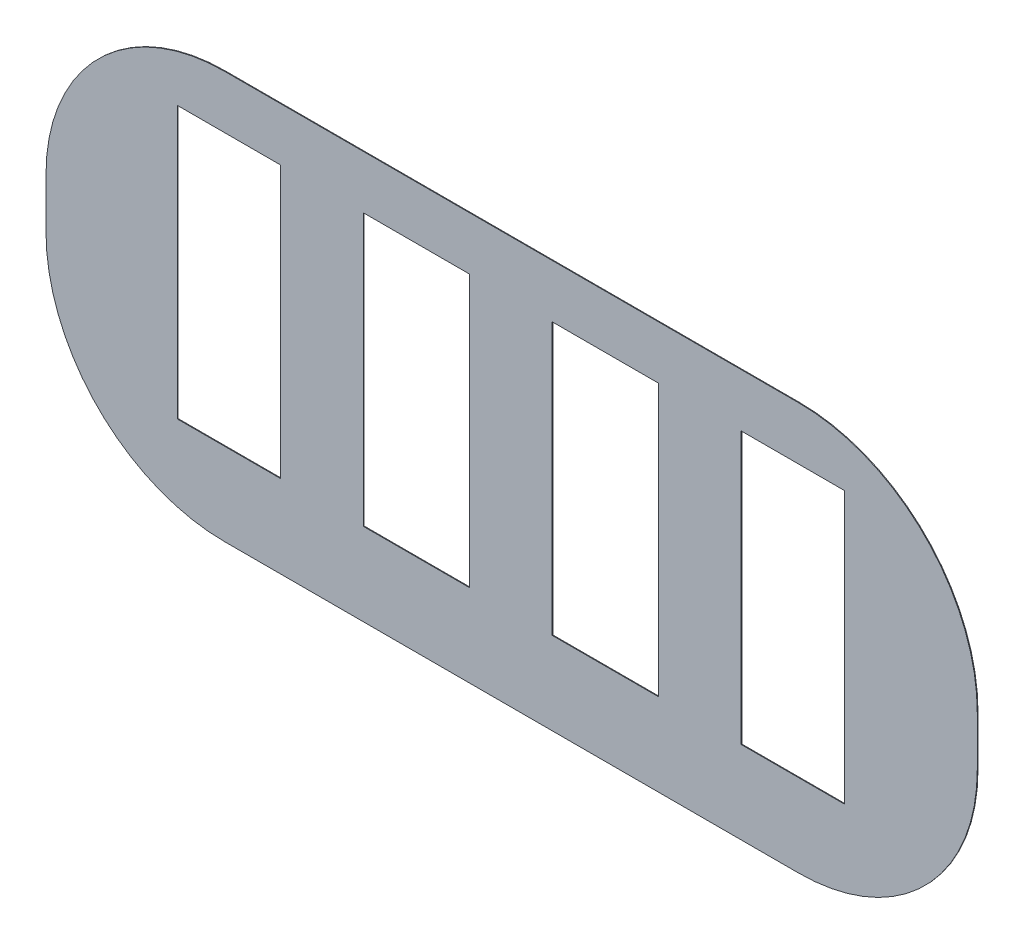
ISO-10303-21;
HEADER;
FILE_DESCRIPTION(('STEP AP214'),'2;1');
FILE_NAME('part.step','',(''),(''),'','','');
FILE_SCHEMA(('AUTOMOTIVE_DESIGN { 1 0 10303 214 1 1 1 1 }'));
ENDSEC;
DATA;
#1=APPLICATION_CONTEXT('core data for automotive mechanical design processes');
#2=APPLICATION_PROTOCOL_DEFINITION('international standard','automotive_design',2000,#1);
#3=PRODUCT_CONTEXT('',#1,'mechanical');
#4=PRODUCT('Part','Part','',(#3));
#5=PRODUCT_RELATED_PRODUCT_CATEGORY('part','',(#4));
#6=PRODUCT_DEFINITION_FORMATION('','',#4);
#7=PRODUCT_DEFINITION_CONTEXT('part definition',#1,'design');
#8=PRODUCT_DEFINITION('design','',#6,#7);
#9=PRODUCT_DEFINITION_SHAPE('','',#8);
#10=(LENGTH_UNIT() NAMED_UNIT(*) SI_UNIT(.MILLI.,.METRE.));
#11=(NAMED_UNIT(*) PLANE_ANGLE_UNIT() SI_UNIT($,.RADIAN.));
#12=(NAMED_UNIT(*) SI_UNIT($,.STERADIAN.) SOLID_ANGLE_UNIT());
#13=UNCERTAINTY_MEASURE_WITH_UNIT(LENGTH_MEASURE(1.E-05),#10,'distance_accuracy_value','');
#14=(GEOMETRIC_REPRESENTATION_CONTEXT(3) GLOBAL_UNCERTAINTY_ASSIGNED_CONTEXT((#13)) GLOBAL_UNIT_ASSIGNED_CONTEXT((#10,
#11,#12)) REPRESENTATION_CONTEXT('',''));
#15=CARTESIAN_POINT('',(0.,0.,0.));
#16=DIRECTION('',(0.,0.,1.));
#17=DIRECTION('',(1.,0.,0.));
#18=AXIS2_PLACEMENT_3D('',#15,#16,#17);
#19=CARTESIAN_POINT('',(12.954,3.0734,0.0127));
#20=DIRECTION('',(0.,0.,-1.));
#21=DIRECTION('',(-1.,0.,0.));
#22=AXIS2_PLACEMENT_3D('',#19,#20,#21);
#23=CYLINDRICAL_SURFACE('',#22,3.0734);
#24=CARTESIAN_POINT('',(12.954,3.0734,0.));
#25=DIRECTION('',(0.,0.,1.));
#26=DIRECTION('',(1.,0.,0.));
#27=AXIS2_PLACEMENT_3D('',#24,#25,#26);
#28=CIRCLE('',#27,3.0734);
#29=CARTESIAN_POINT('',(12.954,0.,0.));
#30=VERTEX_POINT('',#29);
#31=CARTESIAN_POINT('',(16.0274,3.0734,0.));
#32=VERTEX_POINT('',#31);
#33=EDGE_CURVE('E383',#30,#32,#28,.T.);
#34=ORIENTED_EDGE('',*,*,#33,.T.);
#35=DIRECTION('',(0.,0.,-1.));
#36=VECTOR('',#35,1.);
#37=CARTESIAN_POINT('',(16.0274,3.0734,0.0127));
#38=LINE('',#37,#36);
#39=CARTESIAN_POINT('',(16.0274,3.0734,0.0127));
#40=VERTEX_POINT('',#39);
#41=EDGE_CURVE('E11',#40,#32,#38,.T.);
#42=ORIENTED_EDGE('',*,*,#41,.F.);
#43=CARTESIAN_POINT('',(12.954,3.0734,0.0127));
#44=DIRECTION('',(0.,0.,1.));
#45=DIRECTION('',(1.,0.,0.));
#46=AXIS2_PLACEMENT_3D('',#43,#44,#45);
#47=CIRCLE('',#46,3.0734);
#48=CARTESIAN_POINT('',(12.954,0.,0.0127));
#49=VERTEX_POINT('',#48);
#50=EDGE_CURVE('E393',#49,#40,#47,.T.);
#51=ORIENTED_EDGE('',*,*,#50,.F.);
#52=DIRECTION('',(0.,0.,-1.));
#53=VECTOR('',#52,1.);
#54=CARTESIAN_POINT('',(12.954,0.,0.0127));
#55=LINE('',#54,#53);
#56=EDGE_CURVE('E419',#49,#30,#55,.T.);
#57=ORIENTED_EDGE('',*,*,#56,.T.);
#58=EDGE_LOOP('',(#34,#42,#51,#57));
#59=FACE_BOUND('',#58,.T.);
#60=ADVANCED_FACE('F48',(#59),#23,.T.);
#61=CARTESIAN_POINT('',(16.0274,3.0734,0.0127));
#62=DIRECTION('',(-1.,0.,0.));
#63=DIRECTION('',(0.,0.,1.));
#64=AXIS2_PLACEMENT_3D('',#61,#62,#63);
#65=PLANE('',#64);
#66=DIRECTION('',(0.,1.,0.));
#67=VECTOR('',#66,1.);
#68=CARTESIAN_POINT('',(16.0274,3.0734,0.));
#69=LINE('',#68,#67);
#70=CARTESIAN_POINT('',(16.0274,3.937,0.));
#71=VERTEX_POINT('',#70);
#72=EDGE_CURVE('E423',#32,#71,#69,.T.);
#73=ORIENTED_EDGE('',*,*,#72,.T.);
#74=DIRECTION('',(0.,0.,-1.));
#75=VECTOR('',#74,1.);
#76=CARTESIAN_POINT('',(16.0274,3.937,0.0127));
#77=LINE('',#76,#75);
#78=CARTESIAN_POINT('',(16.0274,3.937,0.0127));
#79=VERTEX_POINT('',#78);
#80=EDGE_CURVE('E56',#79,#71,#77,.T.);
#81=ORIENTED_EDGE('',*,*,#80,.F.);
#82=DIRECTION('',(0.,1.,0.));
#83=VECTOR('',#82,1.);
#84=CARTESIAN_POINT('',(16.0274,3.0734,0.0127));
#85=LINE('',#84,#83);
#86=EDGE_CURVE('E397',#40,#79,#85,.T.);
#87=ORIENTED_EDGE('',*,*,#86,.F.);
#88=ORIENTED_EDGE('',*,*,#41,.T.);
#89=EDGE_LOOP('',(#73,#81,#87,#88));
#90=FACE_BOUND('',#89,.T.);
#91=ADVANCED_FACE('F494',(#90),#65,.F.);
#92=CARTESIAN_POINT('',(12.954,3.937,0.0127));
#93=DIRECTION('',(0.,0.,-1.));
#94=DIRECTION('',(-1.,0.,0.));
#95=AXIS2_PLACEMENT_3D('',#92,#93,#94);
#96=CYLINDRICAL_SURFACE('',#95,3.0734);
#97=CARTESIAN_POINT('',(12.954,3.937,0.));
#98=DIRECTION('',(0.,0.,1.));
#99=DIRECTION('',(-1.,0.,0.));
#100=AXIS2_PLACEMENT_3D('',#97,#98,#99);
#101=CIRCLE('',#100,3.0734);
#102=CARTESIAN_POINT('',(12.954,7.0104,0.));
#103=VERTEX_POINT('',#102);
#104=EDGE_CURVE('E426',#71,#103,#101,.T.);
#105=ORIENTED_EDGE('',*,*,#104,.T.);
#106=DIRECTION('',(0.,0.,-1.));
#107=VECTOR('',#106,1.);
#108=CARTESIAN_POINT('',(12.954,7.0104,0.0127));
#109=LINE('',#108,#107);
#110=CARTESIAN_POINT('',(12.954,7.0104,0.0127));
#111=VERTEX_POINT('',#110);
#112=EDGE_CURVE('E462',#111,#103,#109,.T.);
#113=ORIENTED_EDGE('',*,*,#112,.F.);
#114=CARTESIAN_POINT('',(12.954,3.937,0.0127));
#115=DIRECTION('',(0.,0.,1.));
#116=DIRECTION('',(-1.,0.,0.));
#117=AXIS2_PLACEMENT_3D('',#114,#115,#116);
#118=CIRCLE('',#117,3.0734);
#119=EDGE_CURVE('E401',#79,#111,#118,.T.);
#120=ORIENTED_EDGE('',*,*,#119,.F.);
#121=ORIENTED_EDGE('',*,*,#80,.T.);
#122=EDGE_LOOP('',(#105,#113,#120,#121));
#123=FACE_BOUND('',#122,.T.);
#124=ADVANCED_FACE('F472',(#123),#96,.T.);
#125=CARTESIAN_POINT('',(3.07340000000002,7.0104,0.0127));
#126=DIRECTION('',(0.,-1.,0.));
#127=DIRECTION('',(1.,0.,0.));
#128=AXIS2_PLACEMENT_3D('',#125,#126,#127);
#129=PLANE('',#128);
#130=DIRECTION('',(-1.,0.,0.));
#131=VECTOR('',#130,1.);
#132=CARTESIAN_POINT('',(3.07340000000002,7.0104,0.));
#133=LINE('',#132,#131);
#134=CARTESIAN_POINT('',(3.07340000000002,7.0104,0.));
#135=VERTEX_POINT('',#134);
#136=EDGE_CURVE('E429',#103,#135,#133,.T.);
#137=ORIENTED_EDGE('',*,*,#136,.T.);
#138=DIRECTION('',(0.,0.,-1.));
#139=VECTOR('',#138,1.);
#140=CARTESIAN_POINT('',(3.07340000000002,7.0104,0.0127));
#141=LINE('',#140,#139);
#142=CARTESIAN_POINT('',(3.07340000000002,7.0104,0.0127));
#143=VERTEX_POINT('',#142);
#144=EDGE_CURVE('E458',#143,#135,#141,.T.);
#145=ORIENTED_EDGE('',*,*,#144,.F.);
#146=DIRECTION('',(-1.,0.,0.));
#147=VECTOR('',#146,1.);
#148=CARTESIAN_POINT('',(3.07340000000002,7.0104,0.0127));
#149=LINE('',#148,#147);
#150=EDGE_CURVE('E404',#111,#143,#149,.T.);
#151=ORIENTED_EDGE('',*,*,#150,.F.);
#152=ORIENTED_EDGE('',*,*,#112,.T.);
#153=EDGE_LOOP('',(#137,#145,#151,#152));
#154=FACE_BOUND('',#153,.T.);
#155=ADVANCED_FACE('F482',(#154),#129,.F.);
#156=CARTESIAN_POINT('',(3.0734,3.937,0.0127));
#157=DIRECTION('',(0.,0.,-1.));
#158=DIRECTION('',(-1.,0.,0.));
#159=AXIS2_PLACEMENT_3D('',#156,#157,#158);
#160=CYLINDRICAL_SURFACE('',#159,3.0734);
#161=CARTESIAN_POINT('',(3.0734,3.937,0.));
#162=DIRECTION('',(0.,0.,1.));
#163=DIRECTION('',(-1.,0.,0.));
#164=AXIS2_PLACEMENT_3D('',#161,#162,#163);
#165=CIRCLE('',#164,3.0734);
#166=CARTESIAN_POINT('',(0.,3.93699999999998,0.));
#167=VERTEX_POINT('',#166);
#168=EDGE_CURVE('E432',#135,#167,#165,.T.);
#169=ORIENTED_EDGE('',*,*,#168,.T.);
#170=DIRECTION('',(0.,0.,-1.));
#171=VECTOR('',#170,1.);
#172=CARTESIAN_POINT('',(0.,3.93699999999998,0.0127));
#173=LINE('',#172,#171);
#174=CARTESIAN_POINT('',(0.,3.93699999999998,0.0127));
#175=VERTEX_POINT('',#174);
#176=EDGE_CURVE('E454',#175,#167,#173,.T.);
#177=ORIENTED_EDGE('',*,*,#176,.F.);
#178=CARTESIAN_POINT('',(3.0734,3.937,0.0127));
#179=DIRECTION('',(0.,0.,1.));
#180=DIRECTION('',(-1.,0.,0.));
#181=AXIS2_PLACEMENT_3D('',#178,#179,#180);
#182=CIRCLE('',#181,3.0734);
#183=EDGE_CURVE('E407',#143,#175,#182,.T.);
#184=ORIENTED_EDGE('',*,*,#183,.F.);
#185=ORIENTED_EDGE('',*,*,#144,.T.);
#186=EDGE_LOOP('',(#169,#177,#184,#185));
#187=FACE_BOUND('',#186,.T.);
#188=ADVANCED_FACE('F486',(#187),#160,.T.);
#189=CARTESIAN_POINT('',(0.,3.07340000000002,0.0127));
#190=DIRECTION('',(1.,0.,0.));
#191=DIRECTION('',(0.,0.,-1.));
#192=AXIS2_PLACEMENT_3D('',#189,#190,#191);
#193=PLANE('',#192);
#194=DIRECTION('',(0.,-1.,0.));
#195=VECTOR('',#194,1.);
#196=CARTESIAN_POINT('',(0.,3.07340000000002,0.));
#197=LINE('',#196,#195);
#198=CARTESIAN_POINT('',(0.,3.0734,0.));
#199=VERTEX_POINT('',#198);
#200=EDGE_CURVE('E435',#167,#199,#197,.T.);
#201=ORIENTED_EDGE('',*,*,#200,.T.);
#202=DIRECTION('',(0.,0.,-1.));
#203=VECTOR('',#202,1.);
#204=CARTESIAN_POINT('',(0.,3.0734,0.0127));
#205=LINE('',#204,#203);
#206=CARTESIAN_POINT('',(0.,3.0734,0.0127));
#207=VERTEX_POINT('',#206);
#208=EDGE_CURVE('E450',#207,#199,#205,.T.);
#209=ORIENTED_EDGE('',*,*,#208,.F.);
#210=DIRECTION('',(0.,-1.,0.));
#211=VECTOR('',#210,1.);
#212=CARTESIAN_POINT('',(0.,3.07340000000002,0.0127));
#213=LINE('',#212,#211);
#214=EDGE_CURVE('E410',#175,#207,#213,.T.);
#215=ORIENTED_EDGE('',*,*,#214,.F.);
#216=ORIENTED_EDGE('',*,*,#176,.T.);
#217=EDGE_LOOP('',(#201,#209,#215,#216));
#218=FACE_BOUND('',#217,.T.);
#219=ADVANCED_FACE('F507',(#218),#193,.F.);
#220=CARTESIAN_POINT('',(3.0734,3.0734,0.0127));
#221=DIRECTION('',(0.,0.,-1.));
#222=DIRECTION('',(-1.,0.,0.));
#223=AXIS2_PLACEMENT_3D('',#220,#221,#222);
#224=CYLINDRICAL_SURFACE('',#223,3.0734);
#225=CARTESIAN_POINT('',(3.0734,3.0734,0.));
#226=DIRECTION('',(0.,0.,1.));
#227=DIRECTION('',(-1.,0.,0.));
#228=AXIS2_PLACEMENT_3D('',#225,#226,#227);
#229=CIRCLE('',#228,3.0734);
#230=CARTESIAN_POINT('',(3.07340000000002,0.,0.));
#231=VERTEX_POINT('',#230);
#232=EDGE_CURVE('E438',#199,#231,#229,.T.);
#233=ORIENTED_EDGE('',*,*,#232,.T.);
#234=DIRECTION('',(0.,0.,-1.));
#235=VECTOR('',#234,1.);
#236=CARTESIAN_POINT('',(3.07340000000002,0.,0.0127));
#237=LINE('',#236,#235);
#238=CARTESIAN_POINT('',(3.07340000000002,0.,0.0127));
#239=VERTEX_POINT('',#238);
#240=EDGE_CURVE('E446',#239,#231,#237,.T.);
#241=ORIENTED_EDGE('',*,*,#240,.F.);
#242=CARTESIAN_POINT('',(3.0734,3.0734,0.0127));
#243=DIRECTION('',(0.,0.,1.));
#244=DIRECTION('',(-1.,0.,0.));
#245=AXIS2_PLACEMENT_3D('',#242,#243,#244);
#246=CIRCLE('',#245,3.0734);
#247=EDGE_CURVE('E413',#207,#239,#246,.T.);
#248=ORIENTED_EDGE('',*,*,#247,.F.);
#249=ORIENTED_EDGE('',*,*,#208,.T.);
#250=EDGE_LOOP('',(#233,#241,#248,#249));
#251=FACE_BOUND('',#250,.T.);
#252=ADVANCED_FACE('F505',(#251),#224,.T.);
#253=CARTESIAN_POINT('',(3.07340000000002,0.,0.0127));
#254=DIRECTION('',(0.,1.,0.));
#255=DIRECTION('',(0.,0.,1.));
#256=AXIS2_PLACEMENT_3D('',#253,#254,#255);
#257=PLANE('',#256);
#258=DIRECTION('',(1.,0.,0.));
#259=VECTOR('',#258,1.);
#260=CARTESIAN_POINT('',(3.07340000000002,0.,0.));
#261=LINE('',#260,#259);
#262=EDGE_CURVE('E398',#231,#30,#261,.T.);
#263=ORIENTED_EDGE('',*,*,#262,.T.);
#264=ORIENTED_EDGE('',*,*,#56,.F.);
#265=DIRECTION('',(1.,0.,0.));
#266=VECTOR('',#265,1.);
#267=CARTESIAN_POINT('',(3.07340000000002,0.,0.0127));
#268=LINE('',#267,#266);
#269=EDGE_CURVE('E416',#239,#49,#268,.T.);
#270=ORIENTED_EDGE('',*,*,#269,.F.);
#271=ORIENTED_EDGE('',*,*,#240,.T.);
#272=EDGE_LOOP('',(#263,#264,#270,#271));
#273=FACE_BOUND('',#272,.T.);
#274=ADVANCED_FACE('F500',(#273),#257,.F.);
#275=CARTESIAN_POINT('',(12.954,3.0734,0.0127));
#276=DIRECTION('',(0.,0.,1.));
#277=DIRECTION('',(1.,0.,0.));
#278=AXIS2_PLACEMENT_3D('',#275,#276,#277);
#279=PLANE('',#278);
#280=DIRECTION('',(-1.,0.,0.));
#281=VECTOR('',#280,1.);
#282=CARTESIAN_POINT('',(8.7122,6.096,0.0127));
#283=LINE('',#282,#281);
#284=CARTESIAN_POINT('',(10.541,6.096,0.0127));
#285=VERTEX_POINT('',#284);
#286=CARTESIAN_POINT('',(8.7122,6.096,0.0127));
#287=VERTEX_POINT('',#286);
#288=EDGE_CURVE('E306',#285,#287,#283,.T.);
#289=ORIENTED_EDGE('',*,*,#288,.F.);
#290=DIRECTION('',(0.,1.,0.));
#291=VECTOR('',#290,1.);
#292=CARTESIAN_POINT('',(10.541,6.096,0.0127));
#293=LINE('',#292,#291);
#294=CARTESIAN_POINT('',(10.541,1.4224,0.0127));
#295=VERTEX_POINT('',#294);
#296=EDGE_CURVE('E238',#295,#285,#293,.T.);
#297=ORIENTED_EDGE('',*,*,#296,.F.);
#298=DIRECTION('',(1.,0.,0.));
#299=VECTOR('',#298,1.);
#300=CARTESIAN_POINT('',(8.7122,1.4224,0.0127));
#301=LINE('',#300,#299);
#302=CARTESIAN_POINT('',(8.7122,1.4224,0.0127));
#303=VERTEX_POINT('',#302);
#304=EDGE_CURVE('E227',#303,#295,#301,.T.);
#305=ORIENTED_EDGE('',*,*,#304,.F.);
#306=DIRECTION('',(0.,-1.,0.));
#307=VECTOR('',#306,1.);
#308=CARTESIAN_POINT('',(8.7122,6.096,0.0127));
#309=LINE('',#308,#307);
#310=EDGE_CURVE('E246',#287,#303,#309,.T.);
#311=ORIENTED_EDGE('',*,*,#310,.F.);
#312=EDGE_LOOP('',(#289,#297,#305,#311));
#313=FACE_BOUND('',#312,.T.);
#314=DIRECTION('',(0.,-1.,0.));
#315=VECTOR('',#314,1.);
#316=CARTESIAN_POINT('',(11.9634,6.096,0.0127));
#317=LINE('',#316,#315);
#318=CARTESIAN_POINT('',(11.9634,6.096,0.0127));
#319=VERTEX_POINT('',#318);
#320=CARTESIAN_POINT('',(11.9634,1.4224,0.0127));
#321=VERTEX_POINT('',#320);
#322=EDGE_CURVE('E63',#319,#321,#317,.T.);
#323=ORIENTED_EDGE('',*,*,#322,.F.);
#324=DIRECTION('',(-1.,0.,0.));
#325=VECTOR('',#324,1.);
#326=CARTESIAN_POINT('',(11.9634,6.096,0.0127));
#327=LINE('',#326,#325);
#328=CARTESIAN_POINT('',(13.7414,6.096,0.0127));
#329=VERTEX_POINT('',#328);
#330=EDGE_CURVE('E253',#329,#319,#327,.T.);
#331=ORIENTED_EDGE('',*,*,#330,.F.);
#332=DIRECTION('',(0.,1.,0.));
#333=VECTOR('',#332,1.);
#334=CARTESIAN_POINT('',(13.7414,6.096,0.0127));
#335=LINE('',#334,#333);
#336=CARTESIAN_POINT('',(13.7414,1.4224,0.0127));
#337=VERTEX_POINT('',#336);
#338=EDGE_CURVE('E270',#337,#329,#335,.T.);
#339=ORIENTED_EDGE('',*,*,#338,.F.);
#340=DIRECTION('',(1.,0.,0.));
#341=VECTOR('',#340,1.);
#342=CARTESIAN_POINT('',(11.9634,1.4224,0.0127));
#343=LINE('',#342,#341);
#344=EDGE_CURVE('E266',#321,#337,#343,.T.);
#345=ORIENTED_EDGE('',*,*,#344,.F.);
#346=EDGE_LOOP('',(#323,#331,#339,#345));
#347=FACE_BOUND('',#346,.T.);
#348=DIRECTION('',(-1.,0.,0.));
#349=VECTOR('',#348,1.);
#350=CARTESIAN_POINT('',(5.461,6.096,0.0127));
#351=LINE('',#350,#349);
#352=CARTESIAN_POINT('',(7.2898,6.096,0.0127));
#353=VERTEX_POINT('',#352);
#354=CARTESIAN_POINT('',(5.461,6.096,0.0127));
#355=VERTEX_POINT('',#354);
#356=EDGE_CURVE('E327',#353,#355,#351,.T.);
#357=ORIENTED_EDGE('',*,*,#356,.F.);
#358=DIRECTION('',(0.,1.,0.));
#359=VECTOR('',#358,1.);
#360=CARTESIAN_POINT('',(7.2898,6.096,0.0127));
#361=LINE('',#360,#359);
#362=CARTESIAN_POINT('',(7.2898,1.4224,0.0127));
#363=VERTEX_POINT('',#362);
#364=EDGE_CURVE('E292',#363,#353,#361,.T.);
#365=ORIENTED_EDGE('',*,*,#364,.F.);
#366=DIRECTION('',(1.,0.,0.));
#367=VECTOR('',#366,1.);
#368=CARTESIAN_POINT('',(5.461,1.4224,0.0127));
#369=LINE('',#368,#367);
#370=CARTESIAN_POINT('',(5.461,1.4224,0.0127));
#371=VERTEX_POINT('',#370);
#372=EDGE_CURVE('E336',#371,#363,#369,.T.);
#373=ORIENTED_EDGE('',*,*,#372,.F.);
#374=DIRECTION('',(0.,-1.,0.));
#375=VECTOR('',#374,1.);
#376=CARTESIAN_POINT('',(5.461,6.096,0.0127));
#377=LINE('',#376,#375);
#378=EDGE_CURVE('E301',#355,#371,#377,.T.);
#379=ORIENTED_EDGE('',*,*,#378,.F.);
#380=EDGE_LOOP('',(#357,#365,#373,#379));
#381=FACE_BOUND('',#380,.T.);
#382=DIRECTION('',(0.,-1.,0.));
#383=VECTOR('',#382,1.);
#384=CARTESIAN_POINT('',(2.2606,6.096,0.0127));
#385=LINE('',#384,#383);
#386=CARTESIAN_POINT('',(2.2606,6.096,0.0127));
#387=VERTEX_POINT('',#386);
#388=CARTESIAN_POINT('',(2.2606,1.4224,0.0127));
#389=VERTEX_POINT('',#388);
#390=EDGE_CURVE('E345',#387,#389,#385,.T.);
#391=ORIENTED_EDGE('',*,*,#390,.F.);
#392=DIRECTION('',(-1.,0.,0.));
#393=VECTOR('',#392,1.);
#394=CARTESIAN_POINT('',(2.2606,6.096,0.0127));
#395=LINE('',#394,#393);
#396=CARTESIAN_POINT('',(4.0386,6.096,0.0127));
#397=VERTEX_POINT('',#396);
#398=EDGE_CURVE('E354',#397,#387,#395,.T.);
#399=ORIENTED_EDGE('',*,*,#398,.F.);
#400=DIRECTION('',(0.,1.,0.));
#401=VECTOR('',#400,1.);
#402=CARTESIAN_POINT('',(4.0386,6.096,0.0127));
#403=LINE('',#402,#401);
#404=CARTESIAN_POINT('',(4.0386,1.4224,0.0127));
#405=VERTEX_POINT('',#404);
#406=EDGE_CURVE('E373',#405,#397,#403,.T.);
#407=ORIENTED_EDGE('',*,*,#406,.F.);
#408=DIRECTION('',(1.,0.,0.));
#409=VECTOR('',#408,1.);
#410=CARTESIAN_POINT('',(2.2606,1.4224,0.0127));
#411=LINE('',#410,#409);
#412=EDGE_CURVE('E369',#389,#405,#411,.T.);
#413=ORIENTED_EDGE('',*,*,#412,.F.);
#414=EDGE_LOOP('',(#391,#399,#407,#413));
#415=FACE_BOUND('',#414,.T.);
#416=ORIENTED_EDGE('',*,*,#50,.T.);
#417=ORIENTED_EDGE('',*,*,#86,.T.);
#418=ORIENTED_EDGE('',*,*,#119,.T.);
#419=ORIENTED_EDGE('',*,*,#150,.T.);
#420=ORIENTED_EDGE('',*,*,#183,.T.);
#421=ORIENTED_EDGE('',*,*,#214,.T.);
#422=ORIENTED_EDGE('',*,*,#247,.T.);
#423=ORIENTED_EDGE('',*,*,#269,.T.);
#424=EDGE_LOOP('',(#416,#417,#418,#419,#420,#421,#422,#423));
#425=FACE_BOUND('',#424,.T.);
#426=ADVANCED_FACE('F490',(#313,#347,#381,#415,#425),#279,.T.);
#427=CARTESIAN_POINT('',(12.954,3.0734,0.));
#428=DIRECTION('',(0.,0.,1.));
#429=DIRECTION('',(1.,0.,0.));
#430=AXIS2_PLACEMENT_3D('',#427,#428,#429);
#431=PLANE('',#430);
#432=DIRECTION('',(-1.,0.,0.));
#433=VECTOR('',#432,1.);
#434=CARTESIAN_POINT('',(11.9634,6.096,0.));
#435=LINE('',#434,#433);
#436=CARTESIAN_POINT('',(13.7414,6.096,0.));
#437=VERTEX_POINT('',#436);
#438=CARTESIAN_POINT('',(11.9634,6.096,0.));
#439=VERTEX_POINT('',#438);
#440=EDGE_CURVE('E259',#437,#439,#435,.T.);
#441=ORIENTED_EDGE('',*,*,#440,.T.);
#442=DIRECTION('',(0.,-1.,0.));
#443=VECTOR('',#442,1.);
#444=CARTESIAN_POINT('',(11.9634,6.096,0.));
#445=LINE('',#444,#443);
#446=CARTESIAN_POINT('',(11.9634,1.4224,0.));
#447=VERTEX_POINT('',#446);
#448=EDGE_CURVE('E248',#439,#447,#445,.T.);
#449=ORIENTED_EDGE('',*,*,#448,.T.);
#450=DIRECTION('',(1.,0.,0.));
#451=VECTOR('',#450,1.);
#452=CARTESIAN_POINT('',(11.9634,1.4224,0.));
#453=LINE('',#452,#451);
#454=CARTESIAN_POINT('',(13.7414,1.4224,0.));
#455=VERTEX_POINT('',#454);
#456=EDGE_CURVE('E252',#447,#455,#453,.T.);
#457=ORIENTED_EDGE('',*,*,#456,.T.);
#458=DIRECTION('',(0.,1.,0.));
#459=VECTOR('',#458,1.);
#460=CARTESIAN_POINT('',(13.7414,6.096,0.));
#461=LINE('',#460,#459);
#462=EDGE_CURVE('E71',#455,#437,#461,.T.);
#463=ORIENTED_EDGE('',*,*,#462,.T.);
#464=EDGE_LOOP('',(#441,#449,#457,#463));
#465=FACE_BOUND('',#464,.T.);
#466=DIRECTION('',(0.,1.,0.));
#467=VECTOR('',#466,1.);
#468=CARTESIAN_POINT('',(10.541,6.096,0.));
#469=LINE('',#468,#467);
#470=CARTESIAN_POINT('',(10.541,1.4224,0.));
#471=VERTEX_POINT('',#470);
#472=CARTESIAN_POINT('',(10.541,6.096,0.));
#473=VERTEX_POINT('',#472);
#474=EDGE_CURVE('E215',#471,#473,#469,.T.);
#475=ORIENTED_EDGE('',*,*,#474,.T.);
#476=DIRECTION('',(-1.,0.,0.));
#477=VECTOR('',#476,1.);
#478=CARTESIAN_POINT('',(8.7122,6.096,0.));
#479=LINE('',#478,#477);
#480=CARTESIAN_POINT('',(8.7122,6.096,0.));
#481=VERTEX_POINT('',#480);
#482=EDGE_CURVE('E221',#473,#481,#479,.T.);
#483=ORIENTED_EDGE('',*,*,#482,.T.);
#484=DIRECTION('',(0.,-1.,0.));
#485=VECTOR('',#484,1.);
#486=CARTESIAN_POINT('',(8.7122,6.096,0.));
#487=LINE('',#486,#485);
#488=CARTESIAN_POINT('',(8.7122,1.4224,0.));
#489=VERTEX_POINT('',#488);
#490=EDGE_CURVE('E217',#481,#489,#487,.T.);
#491=ORIENTED_EDGE('',*,*,#490,.T.);
#492=DIRECTION('',(1.,0.,0.));
#493=VECTOR('',#492,1.);
#494=CARTESIAN_POINT('',(8.7122,1.4224,0.));
#495=LINE('',#494,#493);
#496=EDGE_CURVE('E210',#489,#471,#495,.T.);
#497=ORIENTED_EDGE('',*,*,#496,.T.);
#498=EDGE_LOOP('',(#475,#483,#491,#497));
#499=FACE_BOUND('',#498,.T.);
#500=DIRECTION('',(0.,1.,0.));
#501=VECTOR('',#500,1.);
#502=CARTESIAN_POINT('',(7.2898,6.096,0.));
#503=LINE('',#502,#501);
#504=CARTESIAN_POINT('',(7.2898,1.4224,0.));
#505=VERTEX_POINT('',#504);
#506=CARTESIAN_POINT('',(7.2898,6.096,0.));
#507=VERTEX_POINT('',#506);
#508=EDGE_CURVE('E287',#505,#507,#503,.T.);
#509=ORIENTED_EDGE('',*,*,#508,.T.);
#510=DIRECTION('',(-1.,0.,0.));
#511=VECTOR('',#510,1.);
#512=CARTESIAN_POINT('',(5.461,6.096,0.));
#513=LINE('',#512,#511);
#514=CARTESIAN_POINT('',(5.461,6.096,0.));
#515=VERTEX_POINT('',#514);
#516=EDGE_CURVE('E330',#507,#515,#513,.T.);
#517=ORIENTED_EDGE('',*,*,#516,.T.);
#518=DIRECTION('',(0.,-1.,0.));
#519=VECTOR('',#518,1.);
#520=CARTESIAN_POINT('',(5.461,6.096,0.));
#521=LINE('',#520,#519);
#522=CARTESIAN_POINT('',(5.461,1.4224,0.));
#523=VERTEX_POINT('',#522);
#524=EDGE_CURVE('E322',#515,#523,#521,.T.);
#525=ORIENTED_EDGE('',*,*,#524,.T.);
#526=DIRECTION('',(1.,0.,0.));
#527=VECTOR('',#526,1.);
#528=CARTESIAN_POINT('',(5.461,1.4224,0.));
#529=LINE('',#528,#527);
#530=EDGE_CURVE('E326',#523,#505,#529,.T.);
#531=ORIENTED_EDGE('',*,*,#530,.T.);
#532=EDGE_LOOP('',(#509,#517,#525,#531));
#533=FACE_BOUND('',#532,.T.);
#534=DIRECTION('',(-1.,0.,0.));
#535=VECTOR('',#534,1.);
#536=CARTESIAN_POINT('',(2.2606,6.096,0.));
#537=LINE('',#536,#535);
#538=CARTESIAN_POINT('',(4.0386,6.096,0.));
#539=VERTEX_POINT('',#538);
#540=CARTESIAN_POINT('',(2.2606,6.096,0.));
#541=VERTEX_POINT('',#540);
#542=EDGE_CURVE('E362',#539,#541,#537,.T.);
#543=ORIENTED_EDGE('',*,*,#542,.T.);
#544=DIRECTION('',(0.,-1.,0.));
#545=VECTOR('',#544,1.);
#546=CARTESIAN_POINT('',(2.2606,6.096,0.));
#547=LINE('',#546,#545);
#548=CARTESIAN_POINT('',(2.2606,1.4224,0.));
#549=VERTEX_POINT('',#548);
#550=EDGE_CURVE('E349',#541,#549,#547,.T.);
#551=ORIENTED_EDGE('',*,*,#550,.T.);
#552=DIRECTION('',(1.,0.,0.));
#553=VECTOR('',#552,1.);
#554=CARTESIAN_POINT('',(2.2606,1.4224,0.));
#555=LINE('',#554,#553);
#556=CARTESIAN_POINT('',(4.0386,1.4224,0.));
#557=VERTEX_POINT('',#556);
#558=EDGE_CURVE('E353',#549,#557,#555,.T.);
#559=ORIENTED_EDGE('',*,*,#558,.T.);
#560=DIRECTION('',(0.,1.,0.));
#561=VECTOR('',#560,1.);
#562=CARTESIAN_POINT('',(4.0386,6.096,0.));
#563=LINE('',#562,#561);
#564=EDGE_CURVE('E358',#557,#539,#563,.T.);
#565=ORIENTED_EDGE('',*,*,#564,.T.);
#566=EDGE_LOOP('',(#543,#551,#559,#565));
#567=FACE_BOUND('',#566,.T.);
#568=ORIENTED_EDGE('',*,*,#33,.F.);
#569=ORIENTED_EDGE('',*,*,#262,.F.);
#570=ORIENTED_EDGE('',*,*,#232,.F.);
#571=ORIENTED_EDGE('',*,*,#200,.F.);
#572=ORIENTED_EDGE('',*,*,#168,.F.);
#573=ORIENTED_EDGE('',*,*,#136,.F.);
#574=ORIENTED_EDGE('',*,*,#104,.F.);
#575=ORIENTED_EDGE('',*,*,#72,.F.);
#576=EDGE_LOOP('',(#568,#569,#570,#571,#572,#573,#574,#575));
#577=FACE_BOUND('',#576,.T.);
#578=ADVANCED_FACE('F212',(#465,#499,#533,#567,#577),#431,.F.);
#579=CARTESIAN_POINT('',(2.2606,6.096,0.));
#580=DIRECTION('',(-1.,0.,0.));
#581=DIRECTION('',(0.,-1.,0.));
#582=AXIS2_PLACEMENT_3D('',#579,#580,#581);
#583=PLANE('',#582);
#584=ORIENTED_EDGE('',*,*,#390,.T.);
#585=DIRECTION('',(0.,0.,1.));
#586=VECTOR('',#585,1.);
#587=CARTESIAN_POINT('',(2.2606,1.4224,0.));
#588=LINE('',#587,#586);
#589=EDGE_CURVE('E366',#549,#389,#588,.T.);
#590=ORIENTED_EDGE('',*,*,#589,.F.);
#591=ORIENTED_EDGE('',*,*,#550,.F.);
#592=DIRECTION('',(0.,0.,1.));
#593=VECTOR('',#592,1.);
#594=CARTESIAN_POINT('',(2.2606,6.096,0.));
#595=LINE('',#594,#593);
#596=EDGE_CURVE('E380',#541,#387,#595,.T.);
#597=ORIENTED_EDGE('',*,*,#596,.T.);
#598=EDGE_LOOP('',(#584,#590,#591,#597));
#599=FACE_BOUND('',#598,.T.);
#600=ADVANCED_FACE('F570',(#599),#583,.F.);
#601=CARTESIAN_POINT('',(2.2606,6.096,0.));
#602=DIRECTION('',(0.,1.,0.));
#603=DIRECTION('',(0.,0.,1.));
#604=AXIS2_PLACEMENT_3D('',#601,#602,#603);
#605=PLANE('',#604);
#606=ORIENTED_EDGE('',*,*,#398,.T.);
#607=ORIENTED_EDGE('',*,*,#596,.F.);
#608=ORIENTED_EDGE('',*,*,#542,.F.);
#609=DIRECTION('',(0.,0.,1.));
#610=VECTOR('',#609,1.);
#611=CARTESIAN_POINT('',(4.0386,6.096,0.));
#612=LINE('',#611,#610);
#613=EDGE_CURVE('E384',#539,#397,#612,.T.);
#614=ORIENTED_EDGE('',*,*,#613,.T.);
#615=EDGE_LOOP('',(#606,#607,#608,#614));
#616=FACE_BOUND('',#615,.T.);
#617=ADVANCED_FACE('F580',(#616),#605,.F.);
#618=CARTESIAN_POINT('',(4.0386,6.096,0.));
#619=DIRECTION('',(1.,0.,0.));
#620=DIRECTION('',(0.,1.,0.));
#621=AXIS2_PLACEMENT_3D('',#618,#619,#620);
#622=PLANE('',#621);
#623=ORIENTED_EDGE('',*,*,#406,.T.);
#624=ORIENTED_EDGE('',*,*,#613,.F.);
#625=ORIENTED_EDGE('',*,*,#564,.F.);
#626=DIRECTION('',(0.,0.,1.));
#627=VECTOR('',#626,1.);
#628=CARTESIAN_POINT('',(4.0386,1.4224,0.));
#629=LINE('',#628,#627);
#630=EDGE_CURVE('E387',#557,#405,#629,.T.);
#631=ORIENTED_EDGE('',*,*,#630,.T.);
#632=EDGE_LOOP('',(#623,#624,#625,#631));
#633=FACE_BOUND('',#632,.T.);
#634=ADVANCED_FACE('F590',(#633),#622,.F.);
#635=CARTESIAN_POINT('',(2.2606,1.4224,0.));
#636=DIRECTION('',(0.,-1.,0.));
#637=DIRECTION('',(0.,0.,-1.));
#638=AXIS2_PLACEMENT_3D('',#635,#636,#637);
#639=PLANE('',#638);
#640=ORIENTED_EDGE('',*,*,#412,.T.);
#641=ORIENTED_EDGE('',*,*,#630,.F.);
#642=ORIENTED_EDGE('',*,*,#558,.F.);
#643=ORIENTED_EDGE('',*,*,#589,.T.);
#644=EDGE_LOOP('',(#640,#641,#642,#643));
#645=FACE_BOUND('',#644,.T.);
#646=ADVANCED_FACE('F600',(#645),#639,.F.);
#647=CARTESIAN_POINT('',(5.461,6.096,0.));
#648=DIRECTION('',(-1.,0.,0.));
#649=DIRECTION('',(0.,-1.,0.));
#650=AXIS2_PLACEMENT_3D('',#647,#648,#649);
#651=PLANE('',#650);
#652=ORIENTED_EDGE('',*,*,#378,.T.);
#653=DIRECTION('',(0.,0.,1.));
#654=VECTOR('',#653,1.);
#655=CARTESIAN_POINT('',(5.461,1.4224,0.));
#656=LINE('',#655,#654);
#657=EDGE_CURVE('E333',#523,#371,#656,.T.);
#658=ORIENTED_EDGE('',*,*,#657,.F.);
#659=ORIENTED_EDGE('',*,*,#524,.F.);
#660=DIRECTION('',(0.,0.,1.));
#661=VECTOR('',#660,1.);
#662=CARTESIAN_POINT('',(5.461,6.096,0.));
#663=LINE('',#662,#661);
#664=EDGE_CURVE('E341',#515,#355,#663,.T.);
#665=ORIENTED_EDGE('',*,*,#664,.T.);
#666=EDGE_LOOP('',(#652,#658,#659,#665));
#667=FACE_BOUND('',#666,.T.);
#668=ADVANCED_FACE('F610',(#667),#651,.F.);
#669=CARTESIAN_POINT('',(5.461,6.096,0.));
#670=DIRECTION('',(0.,1.,0.));
#671=DIRECTION('',(0.,0.,1.));
#672=AXIS2_PLACEMENT_3D('',#669,#670,#671);
#673=PLANE('',#672);
#674=ORIENTED_EDGE('',*,*,#664,.F.);
#675=ORIENTED_EDGE('',*,*,#516,.F.);
#676=DIRECTION('',(0.,0.,1.));
#677=VECTOR('',#676,1.);
#678=CARTESIAN_POINT('',(7.2898,6.096,0.));
#679=LINE('',#678,#677);
#680=EDGE_CURVE('E297',#507,#353,#679,.T.);
#681=ORIENTED_EDGE('',*,*,#680,.T.);
#682=ORIENTED_EDGE('',*,*,#356,.T.);
#683=EDGE_LOOP('',(#674,#675,#681,#682));
#684=FACE_BOUND('',#683,.T.);
#685=ADVANCED_FACE('F620',(#684),#673,.F.);
#686=CARTESIAN_POINT('',(5.461,1.4224,0.));
#687=DIRECTION('',(0.,-1.,0.));
#688=DIRECTION('',(0.,0.,-1.));
#689=AXIS2_PLACEMENT_3D('',#686,#687,#688);
#690=PLANE('',#689);
#691=ORIENTED_EDGE('',*,*,#372,.T.);
#692=DIRECTION('',(0.,0.,1.));
#693=VECTOR('',#692,1.);
#694=CARTESIAN_POINT('',(7.2898,1.4224,0.));
#695=LINE('',#694,#693);
#696=EDGE_CURVE('E291',#505,#363,#695,.T.);
#697=ORIENTED_EDGE('',*,*,#696,.F.);
#698=ORIENTED_EDGE('',*,*,#530,.F.);
#699=ORIENTED_EDGE('',*,*,#657,.T.);
#700=EDGE_LOOP('',(#691,#697,#698,#699));
#701=FACE_BOUND('',#700,.T.);
#702=ADVANCED_FACE('F630',(#701),#690,.F.);
#703=CARTESIAN_POINT('',(7.2898,6.096,0.));
#704=DIRECTION('',(1.,0.,0.));
#705=DIRECTION('',(0.,1.,0.));
#706=AXIS2_PLACEMENT_3D('',#703,#704,#705);
#707=PLANE('',#706);
#708=ORIENTED_EDGE('',*,*,#364,.T.);
#709=ORIENTED_EDGE('',*,*,#680,.F.);
#710=ORIENTED_EDGE('',*,*,#508,.F.);
#711=ORIENTED_EDGE('',*,*,#696,.T.);
#712=EDGE_LOOP('',(#708,#709,#710,#711));
#713=FACE_BOUND('',#712,.T.);
#714=ADVANCED_FACE('F640',(#713),#707,.F.);
#715=CARTESIAN_POINT('',(8.7122,6.096,0.));
#716=DIRECTION('',(-1.,0.,0.));
#717=DIRECTION('',(0.,-1.,0.));
#718=AXIS2_PLACEMENT_3D('',#715,#716,#717);
#719=PLANE('',#718);
#720=ORIENTED_EDGE('',*,*,#310,.T.);
#721=DIRECTION('',(0.,0.,1.));
#722=VECTOR('',#721,1.);
#723=CARTESIAN_POINT('',(8.7122,1.4224,0.));
#724=LINE('',#723,#722);
#725=EDGE_CURVE('E310',#489,#303,#724,.T.);
#726=ORIENTED_EDGE('',*,*,#725,.F.);
#727=ORIENTED_EDGE('',*,*,#490,.F.);
#728=DIRECTION('',(0.,0.,1.));
#729=VECTOR('',#728,1.);
#730=CARTESIAN_POINT('',(8.7122,6.096,0.));
#731=LINE('',#730,#729);
#732=EDGE_CURVE('E296',#481,#287,#731,.T.);
#733=ORIENTED_EDGE('',*,*,#732,.T.);
#734=EDGE_LOOP('',(#720,#726,#727,#733));
#735=FACE_BOUND('',#734,.T.);
#736=ADVANCED_FACE('F650',(#735),#719,.F.);
#737=CARTESIAN_POINT('',(8.7122,6.096,0.));
#738=DIRECTION('',(0.,1.,0.));
#739=DIRECTION('',(0.,0.,1.));
#740=AXIS2_PLACEMENT_3D('',#737,#738,#739);
#741=PLANE('',#740);
#742=ORIENTED_EDGE('',*,*,#732,.F.);
#743=ORIENTED_EDGE('',*,*,#482,.F.);
#744=DIRECTION('',(0.,0.,1.));
#745=VECTOR('',#744,1.);
#746=CARTESIAN_POINT('',(10.541,6.096,0.));
#747=LINE('',#746,#745);
#748=EDGE_CURVE('E232',#473,#285,#747,.T.);
#749=ORIENTED_EDGE('',*,*,#748,.T.);
#750=ORIENTED_EDGE('',*,*,#288,.T.);
#751=EDGE_LOOP('',(#742,#743,#749,#750));
#752=FACE_BOUND('',#751,.T.);
#753=ADVANCED_FACE('F660',(#752),#741,.F.);
#754=CARTESIAN_POINT('',(8.7122,1.4224,0.));
#755=DIRECTION('',(0.,-1.,0.));
#756=DIRECTION('',(0.,0.,-1.));
#757=AXIS2_PLACEMENT_3D('',#754,#755,#756);
#758=PLANE('',#757);
#759=ORIENTED_EDGE('',*,*,#304,.T.);
#760=DIRECTION('',(0.,0.,1.));
#761=VECTOR('',#760,1.);
#762=CARTESIAN_POINT('',(10.541,1.4224,0.));
#763=LINE('',#762,#761);
#764=EDGE_CURVE('E224',#471,#295,#763,.T.);
#765=ORIENTED_EDGE('',*,*,#764,.F.);
#766=ORIENTED_EDGE('',*,*,#496,.F.);
#767=ORIENTED_EDGE('',*,*,#725,.T.);
#768=EDGE_LOOP('',(#759,#765,#766,#767));
#769=FACE_BOUND('',#768,.T.);
#770=ADVANCED_FACE('F225',(#769),#758,.F.);
#771=CARTESIAN_POINT('',(10.541,6.096,0.));
#772=DIRECTION('',(1.,0.,0.));
#773=DIRECTION('',(0.,1.,0.));
#774=AXIS2_PLACEMENT_3D('',#771,#772,#773);
#775=PLANE('',#774);
#776=ORIENTED_EDGE('',*,*,#296,.T.);
#777=ORIENTED_EDGE('',*,*,#748,.F.);
#778=ORIENTED_EDGE('',*,*,#474,.F.);
#779=ORIENTED_EDGE('',*,*,#764,.T.);
#780=EDGE_LOOP('',(#776,#777,#778,#779));
#781=FACE_BOUND('',#780,.T.);
#782=ADVANCED_FACE('F235',(#781),#775,.F.);
#783=CARTESIAN_POINT('',(11.9634,6.096,0.));
#784=DIRECTION('',(-1.,0.,0.));
#785=DIRECTION('',(0.,-1.,0.));
#786=AXIS2_PLACEMENT_3D('',#783,#784,#785);
#787=PLANE('',#786);
#788=ORIENTED_EDGE('',*,*,#322,.T.);
#789=DIRECTION('',(0.,0.,1.));
#790=VECTOR('',#789,1.);
#791=CARTESIAN_POINT('',(11.9634,1.4224,0.));
#792=LINE('',#791,#790);
#793=EDGE_CURVE('E263',#447,#321,#792,.T.);
#794=ORIENTED_EDGE('',*,*,#793,.F.);
#795=ORIENTED_EDGE('',*,*,#448,.F.);
#796=DIRECTION('',(0.,0.,1.));
#797=VECTOR('',#796,1.);
#798=CARTESIAN_POINT('',(11.9634,6.096,0.));
#799=LINE('',#798,#797);
#800=EDGE_CURVE('E242',#439,#319,#799,.T.);
#801=ORIENTED_EDGE('',*,*,#800,.T.);
#802=EDGE_LOOP('',(#788,#794,#795,#801));
#803=FACE_BOUND('',#802,.T.);
#804=ADVANCED_FACE('F687',(#803),#787,.F.);
#805=CARTESIAN_POINT('',(11.9634,6.096,0.));
#806=DIRECTION('',(0.,1.,0.));
#807=DIRECTION('',(0.,0.,1.));
#808=AXIS2_PLACEMENT_3D('',#805,#806,#807);
#809=PLANE('',#808);
#810=ORIENTED_EDGE('',*,*,#330,.T.);
#811=ORIENTED_EDGE('',*,*,#800,.F.);
#812=ORIENTED_EDGE('',*,*,#440,.F.);
#813=DIRECTION('',(0.,0.,1.));
#814=VECTOR('',#813,1.);
#815=CARTESIAN_POINT('',(13.7414,6.096,0.));
#816=LINE('',#815,#814);
#817=EDGE_CURVE('E279',#437,#329,#816,.T.);
#818=ORIENTED_EDGE('',*,*,#817,.T.);
#819=EDGE_LOOP('',(#810,#811,#812,#818));
#820=FACE_BOUND('',#819,.T.);
#821=ADVANCED_FACE('F696',(#820),#809,.F.);
#822=CARTESIAN_POINT('',(13.7414,6.096,0.));
#823=DIRECTION('',(1.,0.,0.));
#824=DIRECTION('',(0.,1.,0.));
#825=AXIS2_PLACEMENT_3D('',#822,#823,#824);
#826=PLANE('',#825);
#827=ORIENTED_EDGE('',*,*,#338,.T.);
#828=ORIENTED_EDGE('',*,*,#817,.F.);
#829=ORIENTED_EDGE('',*,*,#462,.F.);
#830=DIRECTION('',(0.,0.,1.));
#831=VECTOR('',#830,1.);
#832=CARTESIAN_POINT('',(13.7414,1.4224,0.));
#833=LINE('',#832,#831);
#834=EDGE_CURVE('E282',#455,#337,#833,.T.);
#835=ORIENTED_EDGE('',*,*,#834,.T.);
#836=EDGE_LOOP('',(#827,#828,#829,#835));
#837=FACE_BOUND('',#836,.T.);
#838=ADVANCED_FACE('F705',(#837),#826,.F.);
#839=CARTESIAN_POINT('',(11.9634,1.4224,0.));
#840=DIRECTION('',(0.,-1.,0.));
#841=DIRECTION('',(0.,0.,-1.));
#842=AXIS2_PLACEMENT_3D('',#839,#840,#841);
#843=PLANE('',#842);
#844=ORIENTED_EDGE('',*,*,#344,.T.);
#845=ORIENTED_EDGE('',*,*,#834,.F.);
#846=ORIENTED_EDGE('',*,*,#456,.F.);
#847=ORIENTED_EDGE('',*,*,#793,.T.);
#848=EDGE_LOOP('',(#844,#845,#846,#847));
#849=FACE_BOUND('',#848,.T.);
#850=ADVANCED_FACE('F715',(#849),#843,.F.);
#851=CLOSED_SHELL('',(#60,#91,#124,#155,#188,#219,#252,#274,#426,#578,#600,#617,#634,#646,#668,
#685,#702,#714,#736,#753,#770,#782,#804,#821,#838,#850));
#852=MANIFOLD_SOLID_BREP('B2',#851);
#853=ADVANCED_BREP_SHAPE_REPRESENTATION('',(#18,#852),#14);
#854=SHAPE_DEFINITION_REPRESENTATION(#9,#853);
ENDSEC;
END-ISO-10303-21;
